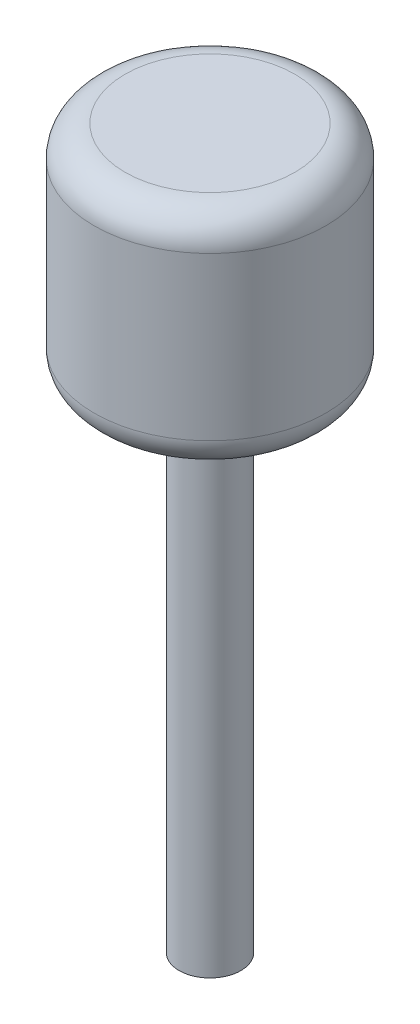
ISO-10303-21;
HEADER;
FILE_DESCRIPTION(('STEP AP214'),'2;1');
FILE_NAME('part.step','',(''),(''),'','','');
FILE_SCHEMA(('AUTOMOTIVE_DESIGN { 1 0 10303 214 1 1 1 1 }'));
ENDSEC;
DATA;
#1=APPLICATION_CONTEXT('core data for automotive mechanical design processes');
#2=APPLICATION_PROTOCOL_DEFINITION('international standard','automotive_design',2000,#1);
#3=PRODUCT_CONTEXT('',#1,'mechanical');
#4=PRODUCT('Part','Part','',(#3));
#5=PRODUCT_RELATED_PRODUCT_CATEGORY('part','',(#4));
#6=PRODUCT_DEFINITION_FORMATION('','',#4);
#7=PRODUCT_DEFINITION_CONTEXT('part definition',#1,'design');
#8=PRODUCT_DEFINITION('design','',#6,#7);
#9=PRODUCT_DEFINITION_SHAPE('','',#8);
#10=(LENGTH_UNIT() NAMED_UNIT(*) SI_UNIT(.MILLI.,.METRE.));
#11=(NAMED_UNIT(*) PLANE_ANGLE_UNIT() SI_UNIT($,.RADIAN.));
#12=(NAMED_UNIT(*) SI_UNIT($,.STERADIAN.) SOLID_ANGLE_UNIT());
#13=UNCERTAINTY_MEASURE_WITH_UNIT(LENGTH_MEASURE(1.E-05),#10,'distance_accuracy_value','');
#14=(GEOMETRIC_REPRESENTATION_CONTEXT(3) GLOBAL_UNCERTAINTY_ASSIGNED_CONTEXT((#13)) GLOBAL_UNIT_ASSIGNED_CONTEXT((#10,
#11,#12)) REPRESENTATION_CONTEXT('',''));
#15=CARTESIAN_POINT('',(0.,0.,0.));
#16=DIRECTION('',(0.,0.,1.));
#17=DIRECTION('',(1.,0.,0.));
#18=AXIS2_PLACEMENT_3D('',#15,#16,#17);
#19=CARTESIAN_POINT('',(0.,30.,0.));
#20=DIRECTION('',(0.,-1.,0.));
#21=DIRECTION('',(0.,0.,-1.));
#22=AXIS2_PLACEMENT_3D('',#19,#20,#21);
#23=CYLINDRICAL_SURFACE('',#22,2.);
#24=CARTESIAN_POINT('',(0.,30.,0.));
#25=DIRECTION('',(0.,1.,0.));
#26=DIRECTION('',(0.,0.,1.));
#27=AXIS2_PLACEMENT_3D('',#24,#25,#26);
#28=CIRCLE('',#27,2.);
#29=CARTESIAN_POINT('',(0.,30.,2.));
#30=VERTEX_POINT('',#29);
#31=EDGE_CURVE('E73',#30,#30,#28,.T.);
#32=ORIENTED_EDGE('',*,*,#31,.F.);
#33=EDGE_LOOP('',(#32));
#34=FACE_BOUND('',#33,.T.);
#35=CARTESIAN_POINT('',(0.,0.,0.));
#36=DIRECTION('',(0.,1.,0.));
#37=DIRECTION('',(0.,0.,1.));
#38=AXIS2_PLACEMENT_3D('',#35,#36,#37);
#39=CIRCLE('',#38,2.);
#40=CARTESIAN_POINT('',(0.,0.,2.));
#41=VERTEX_POINT('',#40);
#42=EDGE_CURVE('E74',#41,#41,#39,.T.);
#43=ORIENTED_EDGE('',*,*,#42,.T.);
#44=EDGE_LOOP('',(#43));
#45=FACE_BOUND('',#44,.T.);
#46=ADVANCED_FACE('F41',(#34,#45),#23,.T.);
#47=CARTESIAN_POINT('',(0.,0.,0.));
#48=DIRECTION('',(0.,1.,0.));
#49=DIRECTION('',(0.,0.,1.));
#50=AXIS2_PLACEMENT_3D('',#47,#48,#49);
#51=PLANE('',#50);
#52=ORIENTED_EDGE('',*,*,#42,.F.);
#53=EDGE_LOOP('',(#52));
#54=FACE_BOUND('',#53,.T.);
#55=ADVANCED_FACE('F84',(#54),#51,.F.);
#56=CARTESIAN_POINT('',(0.,32.,0.));
#57=DIRECTION('',(0.,-1.,0.));
#58=DIRECTION('',(0.,0.,-1.));
#59=AXIS2_PLACEMENT_3D('',#56,#57,#58);
#60=CYLINDRICAL_SURFACE('',#59,3.);
#61=CARTESIAN_POINT('',(0.,30.5,0.));
#62=DIRECTION('',(0.,1.,0.));
#63=DIRECTION('',(0.,0.,1.));
#64=AXIS2_PLACEMENT_3D('',#61,#62,#63);
#65=CIRCLE('',#64,3.);
#66=CARTESIAN_POINT('',(0.,30.5,3.));
#67=VERTEX_POINT('',#66);
#68=EDGE_CURVE('E52',#67,#67,#65,.T.);
#69=ORIENTED_EDGE('',*,*,#68,.T.);
#70=EDGE_LOOP('',(#69));
#71=FACE_BOUND('',#70,.T.);
#72=CARTESIAN_POINT('',(0.,31.5,0.));
#73=DIRECTION('',(0.,1.,0.));
#74=DIRECTION('',(0.,0.,1.));
#75=AXIS2_PLACEMENT_3D('',#72,#73,#74);
#76=CIRCLE('',#75,3.);
#77=CARTESIAN_POINT('',(0.,31.5,3.));
#78=VERTEX_POINT('',#77);
#79=EDGE_CURVE('E56',#78,#78,#76,.F.);
#80=ORIENTED_EDGE('',*,*,#79,.T.);
#81=EDGE_LOOP('',(#80));
#82=FACE_BOUND('',#81,.T.);
#83=ADVANCED_FACE('F89',(#71,#82),#60,.T.);
#84=CARTESIAN_POINT('',(0.,30.,0.));
#85=DIRECTION('',(0.,1.,0.));
#86=DIRECTION('',(0.,0.,1.));
#87=AXIS2_PLACEMENT_3D('',#84,#85,#86);
#88=PLANE('',#87);
#89=CARTESIAN_POINT('',(0.,30.,0.));
#90=DIRECTION('',(0.,1.,0.));
#91=DIRECTION('',(0.,0.,1.));
#92=AXIS2_PLACEMENT_3D('',#89,#90,#91);
#93=CIRCLE('',#92,2.5);
#94=CARTESIAN_POINT('',(0.,30.,2.5));
#95=VERTEX_POINT('',#94);
#96=EDGE_CURVE('E48',#95,#95,#93,.F.);
#97=ORIENTED_EDGE('',*,*,#96,.T.);
#98=EDGE_LOOP('',(#97));
#99=FACE_BOUND('',#98,.T.);
#100=ORIENTED_EDGE('',*,*,#31,.T.);
#101=EDGE_LOOP('',(#100));
#102=FACE_BOUND('',#101,.T.);
#103=ADVANCED_FACE('F80',(#99,#102),#88,.F.);
#104=CARTESIAN_POINT('',(0.,46.5,0.));
#105=DIRECTION('',(0.,-1.,0.));
#106=DIRECTION('',(0.,0.,-1.));
#107=AXIS2_PLACEMENT_3D('',#104,#105,#106);
#108=CYLINDRICAL_SURFACE('',#107,7.5);
#109=CARTESIAN_POINT('',(0.,34.,0.));
#110=DIRECTION('',(0.,1.,0.));
#111=DIRECTION('',(0.,0.,1.));
#112=AXIS2_PLACEMENT_3D('',#109,#110,#111);
#113=CIRCLE('',#112,7.5);
#114=CARTESIAN_POINT('',(0.,34.,7.5));
#115=VERTEX_POINT('',#114);
#116=EDGE_CURVE('E67',#115,#115,#113,.T.);
#117=ORIENTED_EDGE('',*,*,#116,.T.);
#118=EDGE_LOOP('',(#117));
#119=FACE_BOUND('',#118,.T.);
#120=CARTESIAN_POINT('',(0.,44.5,0.));
#121=DIRECTION('',(0.,1.,0.));
#122=DIRECTION('',(0.,0.,1.));
#123=AXIS2_PLACEMENT_3D('',#120,#121,#122);
#124=CIRCLE('',#123,7.5);
#125=CARTESIAN_POINT('',(0.,44.5,7.5));
#126=VERTEX_POINT('',#125);
#127=EDGE_CURVE('E70',#126,#126,#124,.F.);
#128=ORIENTED_EDGE('',*,*,#127,.T.);
#129=EDGE_LOOP('',(#128));
#130=FACE_BOUND('',#129,.T.);
#131=ADVANCED_FACE('F157',(#119,#130),#108,.T.);
#132=CARTESIAN_POINT('',(0.,46.5,0.));
#133=DIRECTION('',(0.,1.,0.));
#134=DIRECTION('',(0.,0.,1.));
#135=AXIS2_PLACEMENT_3D('',#132,#133,#134);
#136=PLANE('',#135);
#137=CARTESIAN_POINT('',(0.,46.5,0.));
#138=DIRECTION('',(0.,1.,0.));
#139=DIRECTION('',(0.,0.,1.));
#140=AXIS2_PLACEMENT_3D('',#137,#138,#139);
#141=CIRCLE('',#140,5.5);
#142=CARTESIAN_POINT('',(0.,46.5,5.5));
#143=VERTEX_POINT('',#142);
#144=EDGE_CURVE('E61',#143,#143,#141,.T.);
#145=ORIENTED_EDGE('',*,*,#144,.T.);
#146=EDGE_LOOP('',(#145));
#147=FACE_BOUND('',#146,.T.);
#148=ADVANCED_FACE('F148',(#147),#136,.T.);
#149=CARTESIAN_POINT('',(0.,32.,0.));
#150=DIRECTION('',(0.,1.,0.));
#151=DIRECTION('',(0.,0.,1.));
#152=AXIS2_PLACEMENT_3D('',#149,#150,#151);
#153=PLANE('',#152);
#154=CARTESIAN_POINT('',(0.,32.,0.));
#155=DIRECTION('',(0.,1.,0.));
#156=DIRECTION('',(0.,0.,1.));
#157=AXIS2_PLACEMENT_3D('',#154,#155,#156);
#158=CIRCLE('',#157,3.5);
#159=CARTESIAN_POINT('',(0.,32.,3.5));
#160=VERTEX_POINT('',#159);
#161=EDGE_CURVE('E10',#160,#160,#158,.T.);
#162=ORIENTED_EDGE('',*,*,#161,.T.);
#163=EDGE_LOOP('',(#162));
#164=FACE_BOUND('',#163,.T.);
#165=CARTESIAN_POINT('',(0.,32.,0.));
#166=DIRECTION('',(0.,1.,0.));
#167=DIRECTION('',(0.,0.,1.));
#168=AXIS2_PLACEMENT_3D('',#165,#166,#167);
#169=CIRCLE('',#168,5.5);
#170=CARTESIAN_POINT('',(0.,32.,5.5));
#171=VERTEX_POINT('',#170);
#172=EDGE_CURVE('E64',#171,#171,#169,.F.);
#173=ORIENTED_EDGE('',*,*,#172,.T.);
#174=EDGE_LOOP('',(#173));
#175=FACE_BOUND('',#174,.T.);
#176=ADVANCED_FACE('F103',(#164,#175),#153,.F.);
#177=CARTESIAN_POINT('',(0.,34.,0.));
#178=DIRECTION('',(0.,1.,0.));
#179=DIRECTION('',(0.,0.,1.));
#180=AXIS2_PLACEMENT_3D('',#177,#178,#179);
#181=TOROIDAL_SURFACE('',#180,5.5,2.);
#182=ORIENTED_EDGE('',*,*,#172,.F.);
#183=EDGE_LOOP('',(#182));
#184=FACE_BOUND('',#183,.T.);
#185=ORIENTED_EDGE('',*,*,#116,.F.);
#186=EDGE_LOOP('',(#185));
#187=FACE_BOUND('',#186,.T.);
#188=ADVANCED_FACE('F99',(#184,#187),#181,.T.);
#189=CARTESIAN_POINT('',(0.,44.5,0.));
#190=DIRECTION('',(0.,1.,0.));
#191=DIRECTION('',(0.,0.,1.));
#192=AXIS2_PLACEMENT_3D('',#189,#190,#191);
#193=TOROIDAL_SURFACE('',#192,5.5,2.);
#194=ORIENTED_EDGE('',*,*,#127,.F.);
#195=EDGE_LOOP('',(#194));
#196=FACE_BOUND('',#195,.T.);
#197=ORIENTED_EDGE('',*,*,#144,.F.);
#198=EDGE_LOOP('',(#197));
#199=FACE_BOUND('',#198,.T.);
#200=ADVANCED_FACE('F102',(#196,#199),#193,.T.);
#201=CARTESIAN_POINT('',(0.,30.5,0.));
#202=DIRECTION('',(0.,1.,0.));
#203=DIRECTION('',(0.,0.,1.));
#204=AXIS2_PLACEMENT_3D('',#201,#202,#203);
#205=TOROIDAL_SURFACE('',#204,2.5,0.5);
#206=ORIENTED_EDGE('',*,*,#96,.F.);
#207=EDGE_LOOP('',(#206));
#208=FACE_BOUND('',#207,.T.);
#209=ORIENTED_EDGE('',*,*,#68,.F.);
#210=EDGE_LOOP('',(#209));
#211=FACE_BOUND('',#210,.T.);
#212=ADVANCED_FACE('F106',(#208,#211),#205,.T.);
#213=CARTESIAN_POINT('',(0.,31.5,0.));
#214=DIRECTION('',(0.,1.,0.));
#215=DIRECTION('',(0.,0.,1.));
#216=AXIS2_PLACEMENT_3D('',#213,#214,#215);
#217=TOROIDAL_SURFACE('',#216,3.5,0.5);
#218=ORIENTED_EDGE('',*,*,#79,.F.);
#219=EDGE_LOOP('',(#218));
#220=FACE_BOUND('',#219,.T.);
#221=ORIENTED_EDGE('',*,*,#161,.F.);
#222=EDGE_LOOP('',(#221));
#223=FACE_BOUND('',#222,.T.);
#224=ADVANCED_FACE('F43',(#220,#223),#217,.F.);
#225=CLOSED_SHELL('',(#46,#55,#83,#103,#131,#148,#176,#188,#200,#212,#224));
#226=MANIFOLD_SOLID_BREP('B2',#225);
#227=ADVANCED_BREP_SHAPE_REPRESENTATION('',(#18,#226),#14);
#228=SHAPE_DEFINITION_REPRESENTATION(#9,#227);
ENDSEC;
END-ISO-10303-21;
